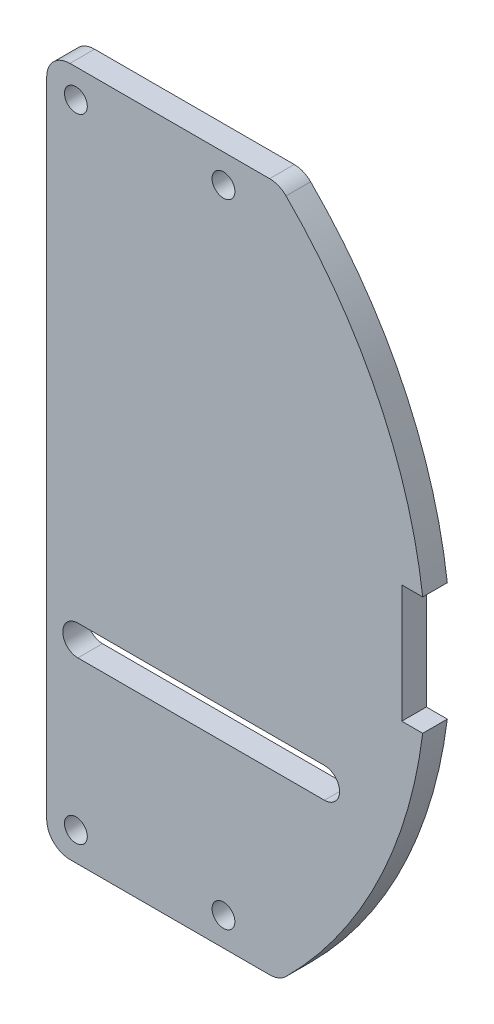
ISO-10303-21;
HEADER;
FILE_DESCRIPTION(('STEP AP214'),'2;1');
FILE_NAME('part.step','',(''),(''),'','','');
FILE_SCHEMA(('AUTOMOTIVE_DESIGN { 1 0 10303 214 1 1 1 1 }'));
ENDSEC;
DATA;
#1=APPLICATION_CONTEXT('core data for automotive mechanical design processes');
#2=APPLICATION_PROTOCOL_DEFINITION('international standard','automotive_design',2000,#1);
#3=PRODUCT_CONTEXT('',#1,'mechanical');
#4=PRODUCT('Part','Part','',(#3));
#5=PRODUCT_RELATED_PRODUCT_CATEGORY('part','',(#4));
#6=PRODUCT_DEFINITION_FORMATION('','',#4);
#7=PRODUCT_DEFINITION_CONTEXT('part definition',#1,'design');
#8=PRODUCT_DEFINITION('design','',#6,#7);
#9=PRODUCT_DEFINITION_SHAPE('','',#8);
#10=(LENGTH_UNIT() NAMED_UNIT(*) SI_UNIT(.MILLI.,.METRE.));
#11=(NAMED_UNIT(*) PLANE_ANGLE_UNIT() SI_UNIT($,.RADIAN.));
#12=(NAMED_UNIT(*) SI_UNIT($,.STERADIAN.) SOLID_ANGLE_UNIT());
#13=UNCERTAINTY_MEASURE_WITH_UNIT(LENGTH_MEASURE(1.E-05),#10,'distance_accuracy_value','');
#14=(GEOMETRIC_REPRESENTATION_CONTEXT(3) GLOBAL_UNCERTAINTY_ASSIGNED_CONTEXT((#13)) GLOBAL_UNIT_ASSIGNED_CONTEXT((#10,
#11,#12)) REPRESENTATION_CONTEXT('',''));
#15=CARTESIAN_POINT('',(0.,0.,0.));
#16=DIRECTION('',(0.,0.,1.));
#17=DIRECTION('',(1.,0.,0.));
#18=AXIS2_PLACEMENT_3D('',#15,#16,#17);
#19=CARTESIAN_POINT('',(-6.37024460958813E-09,0.,3.175));
#20=DIRECTION('',(0.,0.,-1.));
#21=DIRECTION('',(-1.,0.,0.));
#22=AXIS2_PLACEMENT_3D('',#19,#20,#21);
#23=CYLINDRICAL_SURFACE('',#22,61.5950000044044);
#24=CARTESIAN_POINT('',(-6.37024460958813E-09,0.,0.));
#25=DIRECTION('',(0.,0.,1.));
#26=DIRECTION('',(-1.,0.,0.));
#27=AXIS2_PLACEMENT_3D('',#24,#25,#26);
#28=CIRCLE('',#27,61.5950000044044);
#29=CARTESIAN_POINT('',(61.1218424523006,7.62000000000063,0.));
#30=VERTEX_POINT('',#29);
#31=CARTESIAN_POINT('',(43.4836153604898,43.6247546717406,0.));
#32=VERTEX_POINT('',#31);
#33=EDGE_CURVE('E258',#30,#32,#28,.T.);
#34=ORIENTED_EDGE('',*,*,#33,.T.);
#35=DIRECTION('',(0.,0.,-1.));
#36=VECTOR('',#35,1.);
#37=CARTESIAN_POINT('',(43.4836153604898,43.6247546717406,3.175));
#38=LINE('',#37,#36);
#39=CARTESIAN_POINT('',(43.4836153604898,43.6247546717406,3.175));
#40=VERTEX_POINT('',#39);
#41=EDGE_CURVE('E11',#32,#40,#38,.F.);
#42=ORIENTED_EDGE('',*,*,#41,.T.);
#43=CARTESIAN_POINT('',(-6.37024460958813E-09,0.,3.175));
#44=DIRECTION('',(0.,0.,1.));
#45=DIRECTION('',(-1.,0.,0.));
#46=AXIS2_PLACEMENT_3D('',#43,#44,#45);
#47=CIRCLE('',#46,61.5950000044044);
#48=CARTESIAN_POINT('',(61.1218424523006,7.62000000000063,3.175));
#49=VERTEX_POINT('',#48);
#50=EDGE_CURVE('E246',#49,#40,#47,.T.);
#51=ORIENTED_EDGE('',*,*,#50,.F.);
#52=DIRECTION('',(0.,0.,1.));
#53=VECTOR('',#52,1.);
#54=CARTESIAN_POINT('',(61.1218424523006,7.62000000000063,0.));
#55=LINE('',#54,#53);
#56=EDGE_CURVE('E209',#30,#49,#55,.T.);
#57=ORIENTED_EDGE('',*,*,#56,.F.);
#58=EDGE_LOOP('',(#34,#42,#51,#57));
#59=FACE_BOUND('',#58,.T.);
#60=ADVANCED_FACE('F39',(#59),#23,.T.);
#61=CARTESIAN_POINT('',(12.5874867185186,-44.5,3.175));
#62=DIRECTION('',(1.,0.,0.));
#63=DIRECTION('',(0.,0.,-1.));
#64=AXIS2_PLACEMENT_3D('',#61,#62,#63);
#65=PLANE('',#64);
#66=DIRECTION('',(0.,-1.,0.));
#67=VECTOR('',#66,1.);
#68=CARTESIAN_POINT('',(12.5874867185186,-44.5,0.));
#69=LINE('',#68,#67);
#70=CARTESIAN_POINT('',(12.5874867185186,41.5,0.));
#71=VERTEX_POINT('',#70);
#72=CARTESIAN_POINT('',(12.5874867185186,-41.5,0.));
#73=VERTEX_POINT('',#72);
#74=EDGE_CURVE('E236',#71,#73,#69,.T.);
#75=ORIENTED_EDGE('',*,*,#74,.T.);
#76=DIRECTION('',(0.,0.,-1.));
#77=VECTOR('',#76,1.);
#78=CARTESIAN_POINT('',(12.5874867185186,-41.5,3.175));
#79=LINE('',#78,#77);
#80=CARTESIAN_POINT('',(12.5874867185186,-41.5,3.175));
#81=VERTEX_POINT('',#80);
#82=EDGE_CURVE('E278',#73,#81,#79,.F.);
#83=ORIENTED_EDGE('',*,*,#82,.T.);
#84=DIRECTION('',(0.,-1.,0.));
#85=VECTOR('',#84,1.);
#86=CARTESIAN_POINT('',(12.5874867185186,-44.5,3.175));
#87=LINE('',#86,#85);
#88=CARTESIAN_POINT('',(12.5874867185186,41.5,3.175));
#89=VERTEX_POINT('',#88);
#90=EDGE_CURVE('E239',#89,#81,#87,.T.);
#91=ORIENTED_EDGE('',*,*,#90,.F.);
#92=DIRECTION('',(0.,0.,-1.));
#93=VECTOR('',#92,1.);
#94=CARTESIAN_POINT('',(12.5874867185186,41.5,3.175));
#95=LINE('',#94,#93);
#96=EDGE_CURVE('E275',#89,#71,#95,.T.);
#97=ORIENTED_EDGE('',*,*,#96,.T.);
#98=EDGE_LOOP('',(#75,#83,#91,#97));
#99=FACE_BOUND('',#98,.T.);
#100=ADVANCED_FACE('F310',(#99),#65,.F.);
#101=CARTESIAN_POINT('',(12.5874867185186,-44.5,3.175));
#102=DIRECTION('',(0.,1.,0.));
#103=DIRECTION('',(0.,0.,1.));
#104=AXIS2_PLACEMENT_3D('',#101,#102,#103);
#105=PLANE('',#104);
#106=DIRECTION('',(1.,0.,0.));
#107=VECTOR('',#106,1.);
#108=CARTESIAN_POINT('',(12.5874867185186,-44.5,3.175));
#109=LINE('',#108,#107);
#110=CARTESIAN_POINT('',(15.5874867185186,-44.5,3.175));
#111=VERTEX_POINT('',#110);
#112=CARTESIAN_POINT('',(41.365734914167,-44.5,3.175));
#113=VERTEX_POINT('',#112);
#114=EDGE_CURVE('E242',#111,#113,#109,.T.);
#115=ORIENTED_EDGE('',*,*,#114,.F.);
#116=DIRECTION('',(0.,0.,-1.));
#117=VECTOR('',#116,1.);
#118=CARTESIAN_POINT('',(15.5874867185186,-44.5,3.175));
#119=LINE('',#118,#117);
#120=CARTESIAN_POINT('',(15.5874867185186,-44.5,0.));
#121=VERTEX_POINT('',#120);
#122=EDGE_CURVE('E264',#111,#121,#119,.T.);
#123=ORIENTED_EDGE('',*,*,#122,.T.);
#124=DIRECTION('',(1.,0.,0.));
#125=VECTOR('',#124,1.);
#126=CARTESIAN_POINT('',(12.5874867185186,-44.5,0.));
#127=LINE('',#126,#125);
#128=CARTESIAN_POINT('',(41.365734914167,-44.5,0.));
#129=VERTEX_POINT('',#128);
#130=EDGE_CURVE('E255',#121,#129,#127,.T.);
#131=ORIENTED_EDGE('',*,*,#130,.T.);
#132=DIRECTION('',(0.,0.,-1.));
#133=VECTOR('',#132,1.);
#134=CARTESIAN_POINT('',(41.365734914167,-44.5,3.175));
#135=LINE('',#134,#133);
#136=EDGE_CURVE('E252',#129,#113,#135,.F.);
#137=ORIENTED_EDGE('',*,*,#136,.T.);
#138=EDGE_LOOP('',(#115,#123,#131,#137));
#139=FACE_BOUND('',#138,.T.);
#140=ADVANCED_FACE('F320',(#139),#105,.F.);
#141=CARTESIAN_POINT('',(43.4836153604898,-43.6247546717406,3.175));
#142=VERTEX_POINT('',#141);
#143=CARTESIAN_POINT('',(61.1218424523007,-7.6199999999994,3.175));
#144=VERTEX_POINT('',#143);
#145=EDGE_CURVE('E247',#142,#144,#47,.T.);
#146=ORIENTED_EDGE('',*,*,#145,.F.);
#147=DIRECTION('',(0.,0.,-1.));
#148=VECTOR('',#147,1.);
#149=CARTESIAN_POINT('',(43.4836153604898,-43.6247546717406,3.175));
#150=LINE('',#149,#148);
#151=CARTESIAN_POINT('',(43.4836153604898,-43.6247546717406,0.));
#152=VERTEX_POINT('',#151);
#153=EDGE_CURVE('E288',#142,#152,#150,.T.);
#154=ORIENTED_EDGE('',*,*,#153,.T.);
#155=CARTESIAN_POINT('',(61.1218424523007,-7.61999999999937,0.));
#156=VERTEX_POINT('',#155);
#157=EDGE_CURVE('E259',#152,#156,#28,.T.);
#158=ORIENTED_EDGE('',*,*,#157,.T.);
#159=DIRECTION('',(0.,0.,1.));
#160=VECTOR('',#159,1.);
#161=CARTESIAN_POINT('',(61.1218424523007,-7.6199999999994,0.));
#162=LINE('',#161,#160);
#163=EDGE_CURVE('E211',#156,#144,#162,.T.);
#164=ORIENTED_EDGE('',*,*,#163,.T.);
#165=EDGE_LOOP('',(#146,#154,#158,#164));
#166=FACE_BOUND('',#165,.T.);
#167=ADVANCED_FACE('F329',(#166),#23,.T.);
#168=CARTESIAN_POINT('',(12.5874867185186,44.5,3.175));
#169=DIRECTION('',(0.,-1.,0.));
#170=DIRECTION('',(1.,0.,0.));
#171=AXIS2_PLACEMENT_3D('',#168,#169,#170);
#172=PLANE('',#171);
#173=DIRECTION('',(-1.,0.,0.));
#174=VECTOR('',#173,1.);
#175=CARTESIAN_POINT('',(12.5874867185186,44.5,0.));
#176=LINE('',#175,#174);
#177=CARTESIAN_POINT('',(41.365734914167,44.5,0.));
#178=VERTEX_POINT('',#177);
#179=CARTESIAN_POINT('',(15.5874867185186,44.5,0.));
#180=VERTEX_POINT('',#179);
#181=EDGE_CURVE('E243',#178,#180,#176,.T.);
#182=ORIENTED_EDGE('',*,*,#181,.T.);
#183=DIRECTION('',(0.,0.,-1.));
#184=VECTOR('',#183,1.);
#185=CARTESIAN_POINT('',(15.5874867185186,44.5,3.175));
#186=LINE('',#185,#184);
#187=CARTESIAN_POINT('',(15.5874867185186,44.5,3.175));
#188=VERTEX_POINT('',#187);
#189=EDGE_CURVE('E47',#180,#188,#186,.F.);
#190=ORIENTED_EDGE('',*,*,#189,.T.);
#191=DIRECTION('',(-1.,0.,0.));
#192=VECTOR('',#191,1.);
#193=CARTESIAN_POINT('',(12.5874867185186,44.5,3.175));
#194=LINE('',#193,#192);
#195=CARTESIAN_POINT('',(41.365734914167,44.5,3.175));
#196=VERTEX_POINT('',#195);
#197=EDGE_CURVE('E249',#196,#188,#194,.T.);
#198=ORIENTED_EDGE('',*,*,#197,.F.);
#199=DIRECTION('',(0.,0.,-1.));
#200=VECTOR('',#199,1.);
#201=CARTESIAN_POINT('',(41.365734914167,44.5,3.175));
#202=LINE('',#201,#200);
#203=EDGE_CURVE('E291',#196,#178,#202,.T.);
#204=ORIENTED_EDGE('',*,*,#203,.T.);
#205=EDGE_LOOP('',(#182,#190,#198,#204));
#206=FACE_BOUND('',#205,.T.);
#207=ADVANCED_FACE('F296',(#206),#172,.F.);
#208=CARTESIAN_POINT('',(-6.37024460958813E-09,0.,3.175));
#209=DIRECTION('',(0.,0.,-1.));
#210=DIRECTION('',(-1.,0.,0.));
#211=AXIS2_PLACEMENT_3D('',#208,#209,#210);
#212=PLANE('',#211);
#213=DIRECTION('',(1.,0.,0.));
#214=VECTOR('',#213,1.);
#215=CARTESIAN_POINT('',(16.6121620614427,-21.4457630129671,3.175));
#216=LINE('',#215,#214);
#217=CARTESIAN_POINT('',(16.6121620614427,-21.4457630129671,3.175));
#218=VERTEX_POINT('',#217);
#219=CARTESIAN_POINT('',(48.4447636024084,-21.4457630129671,3.175));
#220=VERTEX_POINT('',#219);
#221=EDGE_CURVE('E178',#218,#220,#216,.T.);
#222=ORIENTED_EDGE('',*,*,#221,.F.);
#223=CARTESIAN_POINT('',(16.6121620614427,-19.5000000000013,3.175));
#224=DIRECTION('',(0.,0.,1.));
#225=DIRECTION('',(1.,0.,0.));
#226=AXIS2_PLACEMENT_3D('',#223,#224,#225);
#227=CIRCLE('',#226,1.94576301296578);
#228=CARTESIAN_POINT('',(16.6121620614427,-17.5542369870355,3.175));
#229=VERTEX_POINT('',#228);
#230=EDGE_CURVE('E54',#229,#218,#227,.T.);
#231=ORIENTED_EDGE('',*,*,#230,.F.);
#232=DIRECTION('',(-1.,0.,0.));
#233=VECTOR('',#232,1.);
#234=CARTESIAN_POINT('',(16.6121620614427,-17.5542369870355,3.175));
#235=LINE('',#234,#233);
#236=CARTESIAN_POINT('',(48.4447636024084,-17.5542369870355,3.175));
#237=VERTEX_POINT('',#236);
#238=EDGE_CURVE('E169',#237,#229,#235,.T.);
#239=ORIENTED_EDGE('',*,*,#238,.F.);
#240=CARTESIAN_POINT('',(48.4447636024084,-19.5000000000013,3.175));
#241=DIRECTION('',(0.,0.,1.));
#242=DIRECTION('',(1.,0.,0.));
#243=AXIS2_PLACEMENT_3D('',#240,#241,#242);
#244=CIRCLE('',#243,1.94576301296578);
#245=EDGE_CURVE('E172',#220,#237,#244,.T.);
#246=ORIENTED_EDGE('',*,*,#245,.F.);
#247=EDGE_LOOP('',(#222,#231,#239,#246));
#248=FACE_BOUND('',#247,.T.);
#249=CARTESIAN_POINT('',(16.3543111861162,40.8118922104986,3.175));
#250=DIRECTION('',(0.,0.,1.));
#251=DIRECTION('',(-1.,0.,0.));
#252=AXIS2_PLACEMENT_3D('',#249,#250,#251);
#253=CIRCLE('',#252,1.4732);
#254=CARTESIAN_POINT('',(14.8811111861162,40.8118922104986,3.175));
#255=VERTEX_POINT('',#254);
#256=EDGE_CURVE('E221',#255,#255,#253,.T.);
#257=ORIENTED_EDGE('',*,*,#256,.F.);
#258=EDGE_LOOP('',(#257));
#259=FACE_BOUND('',#258,.T.);
#260=CARTESIAN_POINT('',(35.4043111861162,-40.8118922104987,3.175));
#261=DIRECTION('',(0.,0.,1.));
#262=DIRECTION('',(1.,0.,0.));
#263=AXIS2_PLACEMENT_3D('',#260,#261,#262);
#264=CIRCLE('',#263,1.4732);
#265=CARTESIAN_POINT('',(36.8775111861162,-40.8118922104987,3.175));
#266=VERTEX_POINT('',#265);
#267=EDGE_CURVE('E228',#266,#266,#264,.T.);
#268=ORIENTED_EDGE('',*,*,#267,.F.);
#269=EDGE_LOOP('',(#268));
#270=FACE_BOUND('',#269,.T.);
#271=CARTESIAN_POINT('',(35.4043111861162,40.8118922104986,3.175));
#272=DIRECTION('',(0.,0.,1.));
#273=DIRECTION('',(-1.,0.,0.));
#274=AXIS2_PLACEMENT_3D('',#271,#272,#273);
#275=CIRCLE('',#274,1.4732);
#276=CARTESIAN_POINT('',(33.9311111861162,40.8118922104986,3.175));
#277=VERTEX_POINT('',#276);
#278=EDGE_CURVE('E215',#277,#277,#275,.T.);
#279=ORIENTED_EDGE('',*,*,#278,.F.);
#280=EDGE_LOOP('',(#279));
#281=FACE_BOUND('',#280,.T.);
#282=CARTESIAN_POINT('',(16.3543111861162,-40.8118922104987,3.175));
#283=DIRECTION('',(0.,0.,1.));
#284=DIRECTION('',(1.,0.,0.));
#285=AXIS2_PLACEMENT_3D('',#282,#283,#284);
#286=CIRCLE('',#285,1.4732);
#287=CARTESIAN_POINT('',(17.8275111861162,-40.8118922104987,3.175));
#288=VERTEX_POINT('',#287);
#289=EDGE_CURVE('E224',#288,#288,#286,.T.);
#290=ORIENTED_EDGE('',*,*,#289,.F.);
#291=EDGE_LOOP('',(#290));
#292=FACE_BOUND('',#291,.T.);
#293=ORIENTED_EDGE('',*,*,#90,.T.);
#294=CARTESIAN_POINT('',(15.5874867185186,-41.5,3.175));
#295=DIRECTION('',(0.,0.,-1.));
#296=DIRECTION('',(-1.,0.,0.));
#297=AXIS2_PLACEMENT_3D('',#294,#295,#296);
#298=CIRCLE('',#297,3.);
#299=EDGE_CURVE('E286',#81,#111,#298,.F.);
#300=ORIENTED_EDGE('',*,*,#299,.T.);
#301=ORIENTED_EDGE('',*,*,#114,.T.);
#302=CARTESIAN_POINT('',(41.365734914167,-41.5,3.175));
#303=DIRECTION('',(0.,0.,-1.));
#304=DIRECTION('',(-1.,0.,0.));
#305=AXIS2_PLACEMENT_3D('',#302,#303,#304);
#306=CIRCLE('',#305,3.);
#307=EDGE_CURVE('E284',#113,#142,#306,.F.);
#308=ORIENTED_EDGE('',*,*,#307,.T.);
#309=ORIENTED_EDGE('',*,*,#145,.T.);
#310=DIRECTION('',(1.,0.,0.));
#311=VECTOR('',#310,1.);
#312=CARTESIAN_POINT('',(58.4200000000001,-7.6199999999994,3.175));
#313=LINE('',#312,#311);
#314=CARTESIAN_POINT('',(58.4200000000001,-7.6199999999994,3.175));
#315=VERTEX_POINT('',#314);
#316=EDGE_CURVE('E201',#315,#144,#313,.T.);
#317=ORIENTED_EDGE('',*,*,#316,.F.);
#318=DIRECTION('',(0.,-1.,0.));
#319=VECTOR('',#318,1.);
#320=CARTESIAN_POINT('',(58.4199999999999,7.6200000000006,3.175));
#321=LINE('',#320,#319);
#322=CARTESIAN_POINT('',(58.4199999999999,7.6200000000006,3.175));
#323=VERTEX_POINT('',#322);
#324=EDGE_CURVE('E184',#323,#315,#321,.T.);
#325=ORIENTED_EDGE('',*,*,#324,.F.);
#326=DIRECTION('',(-1.,0.,0.));
#327=VECTOR('',#326,1.);
#328=CARTESIAN_POINT('',(58.4199999999999,7.6200000000006,3.175));
#329=LINE('',#328,#327);
#330=EDGE_CURVE('E192',#49,#323,#329,.T.);
#331=ORIENTED_EDGE('',*,*,#330,.F.);
#332=ORIENTED_EDGE('',*,*,#50,.T.);
#333=CARTESIAN_POINT('',(41.365734914167,41.5,3.175));
#334=DIRECTION('',(0.,0.,-1.));
#335=DIRECTION('',(-1.,0.,0.));
#336=AXIS2_PLACEMENT_3D('',#333,#334,#335);
#337=CIRCLE('',#336,3.);
#338=EDGE_CURVE('E280',#40,#196,#337,.F.);
#339=ORIENTED_EDGE('',*,*,#338,.T.);
#340=ORIENTED_EDGE('',*,*,#197,.T.);
#341=CARTESIAN_POINT('',(15.5874867185186,41.5,3.175));
#342=DIRECTION('',(0.,0.,-1.));
#343=DIRECTION('',(-1.,0.,0.));
#344=AXIS2_PLACEMENT_3D('',#341,#342,#343);
#345=CIRCLE('',#344,3.);
#346=EDGE_CURVE('E282',#188,#89,#345,.F.);
#347=ORIENTED_EDGE('',*,*,#346,.T.);
#348=EDGE_LOOP('',(#293,#300,#301,#308,#309,#317,#325,#331,#332,#339,#340,#347));
#349=FACE_BOUND('',#348,.T.);
#350=ADVANCED_FACE('F302',(#248,#259,#270,#281,#292,#349),#212,.F.);
#351=CARTESIAN_POINT('',(-6.37024460958813E-09,0.,0.));
#352=DIRECTION('',(0.,0.,-1.));
#353=DIRECTION('',(-1.,0.,0.));
#354=AXIS2_PLACEMENT_3D('',#351,#352,#353);
#355=PLANE('',#354);
#356=CARTESIAN_POINT('',(16.6121620614427,-19.5000000000013,0.));
#357=DIRECTION('',(0.,0.,1.));
#358=DIRECTION('',(1.,0.,0.));
#359=AXIS2_PLACEMENT_3D('',#356,#357,#358);
#360=CIRCLE('',#359,1.94576301296578);
#361=CARTESIAN_POINT('',(16.6121620614427,-17.5542369870355,0.));
#362=VERTEX_POINT('',#361);
#363=CARTESIAN_POINT('',(16.6121620614427,-21.4457630129671,0.));
#364=VERTEX_POINT('',#363);
#365=EDGE_CURVE('E153',#362,#364,#360,.T.);
#366=ORIENTED_EDGE('',*,*,#365,.T.);
#367=DIRECTION('',(1.,0.,0.));
#368=VECTOR('',#367,1.);
#369=CARTESIAN_POINT('',(16.6121620614427,-21.4457630129671,0.));
#370=LINE('',#369,#368);
#371=CARTESIAN_POINT('',(48.4447636024084,-21.4457630129671,0.));
#372=VERTEX_POINT('',#371);
#373=EDGE_CURVE('E162',#364,#372,#370,.T.);
#374=ORIENTED_EDGE('',*,*,#373,.T.);
#375=CARTESIAN_POINT('',(48.4447636024084,-19.5000000000013,0.));
#376=DIRECTION('',(0.,0.,1.));
#377=DIRECTION('',(1.,0.,0.));
#378=AXIS2_PLACEMENT_3D('',#375,#376,#377);
#379=CIRCLE('',#378,1.94576301296578);
#380=CARTESIAN_POINT('',(48.4447636024084,-17.5542369870355,0.));
#381=VERTEX_POINT('',#380);
#382=EDGE_CURVE('E62',#372,#381,#379,.T.);
#383=ORIENTED_EDGE('',*,*,#382,.T.);
#384=DIRECTION('',(-1.,0.,0.));
#385=VECTOR('',#384,1.);
#386=CARTESIAN_POINT('',(16.6121620614427,-17.5542369870355,0.));
#387=LINE('',#386,#385);
#388=EDGE_CURVE('E159',#381,#362,#387,.T.);
#389=ORIENTED_EDGE('',*,*,#388,.T.);
#390=EDGE_LOOP('',(#366,#374,#383,#389));
#391=FACE_BOUND('',#390,.T.);
#392=ORIENTED_EDGE('',*,*,#130,.F.);
#393=CARTESIAN_POINT('',(15.5874867185186,-41.5,0.));
#394=DIRECTION('',(0.,0.,-1.));
#395=DIRECTION('',(-1.,0.,0.));
#396=AXIS2_PLACEMENT_3D('',#393,#394,#395);
#397=CIRCLE('',#396,3.);
#398=EDGE_CURVE('E273',#121,#73,#397,.T.);
#399=ORIENTED_EDGE('',*,*,#398,.T.);
#400=ORIENTED_EDGE('',*,*,#74,.F.);
#401=CARTESIAN_POINT('',(15.5874867185186,41.5,0.));
#402=DIRECTION('',(0.,0.,-1.));
#403=DIRECTION('',(-1.,0.,0.));
#404=AXIS2_PLACEMENT_3D('',#401,#402,#403);
#405=CIRCLE('',#404,3.);
#406=EDGE_CURVE('E269',#71,#180,#405,.T.);
#407=ORIENTED_EDGE('',*,*,#406,.T.);
#408=ORIENTED_EDGE('',*,*,#181,.F.);
#409=CARTESIAN_POINT('',(41.365734914167,41.5,0.));
#410=DIRECTION('',(0.,0.,-1.));
#411=DIRECTION('',(-1.,0.,0.));
#412=AXIS2_PLACEMENT_3D('',#409,#410,#411);
#413=CIRCLE('',#412,3.);
#414=EDGE_CURVE('E267',#178,#32,#413,.T.);
#415=ORIENTED_EDGE('',*,*,#414,.T.);
#416=ORIENTED_EDGE('',*,*,#33,.F.);
#417=DIRECTION('',(-1.,0.,0.));
#418=VECTOR('',#417,1.);
#419=CARTESIAN_POINT('',(58.4199999999999,7.6200000000006,0.));
#420=LINE('',#419,#418);
#421=CARTESIAN_POINT('',(58.4199999999999,7.6200000000006,0.));
#422=VERTEX_POINT('',#421);
#423=EDGE_CURVE('E195',#30,#422,#420,.T.);
#424=ORIENTED_EDGE('',*,*,#423,.T.);
#425=DIRECTION('',(0.,-1.,0.));
#426=VECTOR('',#425,1.);
#427=CARTESIAN_POINT('',(58.4199999999999,7.6200000000006,0.));
#428=LINE('',#427,#426);
#429=CARTESIAN_POINT('',(58.4200000000001,-7.6199999999994,0.));
#430=VERTEX_POINT('',#429);
#431=EDGE_CURVE('E188',#422,#430,#428,.T.);
#432=ORIENTED_EDGE('',*,*,#431,.T.);
#433=DIRECTION('',(1.,0.,0.));
#434=VECTOR('',#433,1.);
#435=CARTESIAN_POINT('',(58.4200000000001,-7.6199999999994,0.));
#436=LINE('',#435,#434);
#437=EDGE_CURVE('E191',#430,#156,#436,.T.);
#438=ORIENTED_EDGE('',*,*,#437,.T.);
#439=ORIENTED_EDGE('',*,*,#157,.F.);
#440=CARTESIAN_POINT('',(41.365734914167,-41.5,0.));
#441=DIRECTION('',(0.,0.,-1.));
#442=DIRECTION('',(-1.,0.,0.));
#443=AXIS2_PLACEMENT_3D('',#440,#441,#442);
#444=CIRCLE('',#443,3.);
#445=EDGE_CURVE('E271',#152,#129,#444,.T.);
#446=ORIENTED_EDGE('',*,*,#445,.T.);
#447=EDGE_LOOP('',(#392,#399,#400,#407,#408,#415,#416,#424,#432,#438,#439,#446));
#448=FACE_BOUND('',#447,.T.);
#449=CARTESIAN_POINT('',(16.3543111861162,40.8118922104986,0.));
#450=DIRECTION('',(0.,0.,1.));
#451=DIRECTION('',(-1.,0.,0.));
#452=AXIS2_PLACEMENT_3D('',#449,#450,#451);
#453=CIRCLE('',#452,1.4732);
#454=CARTESIAN_POINT('',(14.8811111861162,40.8118922104986,0.));
#455=VERTEX_POINT('',#454);
#456=EDGE_CURVE('E225',#455,#455,#453,.T.);
#457=ORIENTED_EDGE('',*,*,#456,.T.);
#458=EDGE_LOOP('',(#457));
#459=FACE_BOUND('',#458,.T.);
#460=CARTESIAN_POINT('',(35.4043111861162,-40.8118922104987,0.));
#461=DIRECTION('',(0.,0.,1.));
#462=DIRECTION('',(1.,0.,0.));
#463=AXIS2_PLACEMENT_3D('',#460,#461,#462);
#464=CIRCLE('',#463,1.4732);
#465=CARTESIAN_POINT('',(36.8775111861162,-40.8118922104987,0.));
#466=VERTEX_POINT('',#465);
#467=EDGE_CURVE('E218',#466,#466,#464,.T.);
#468=ORIENTED_EDGE('',*,*,#467,.T.);
#469=EDGE_LOOP('',(#468));
#470=FACE_BOUND('',#469,.T.);
#471=CARTESIAN_POINT('',(35.4043111861162,40.8118922104986,0.));
#472=DIRECTION('',(0.,0.,1.));
#473=DIRECTION('',(-1.,0.,0.));
#474=AXIS2_PLACEMENT_3D('',#471,#472,#473);
#475=CIRCLE('',#474,1.4732);
#476=CARTESIAN_POINT('',(33.9311111861162,40.8118922104986,0.));
#477=VERTEX_POINT('',#476);
#478=EDGE_CURVE('E208',#477,#477,#475,.T.);
#479=ORIENTED_EDGE('',*,*,#478,.T.);
#480=EDGE_LOOP('',(#479));
#481=FACE_BOUND('',#480,.T.);
#482=CARTESIAN_POINT('',(16.3543111861162,-40.8118922104987,0.));
#483=DIRECTION('',(0.,0.,1.));
#484=DIRECTION('',(1.,0.,0.));
#485=AXIS2_PLACEMENT_3D('',#482,#483,#484);
#486=CIRCLE('',#485,1.4732);
#487=CARTESIAN_POINT('',(17.8275111861162,-40.8118922104987,0.));
#488=VERTEX_POINT('',#487);
#489=EDGE_CURVE('E233',#488,#488,#486,.T.);
#490=ORIENTED_EDGE('',*,*,#489,.T.);
#491=EDGE_LOOP('',(#490));
#492=FACE_BOUND('',#491,.T.);
#493=ADVANCED_FACE('F166',(#391,#448,#459,#470,#481,#492),#355,.T.);
#494=CARTESIAN_POINT('',(16.3543111861162,-40.8118922104987,0.));
#495=DIRECTION('',(0.,0.,1.));
#496=DIRECTION('',(1.,0.,0.));
#497=AXIS2_PLACEMENT_3D('',#494,#495,#496);
#498=CYLINDRICAL_SURFACE('',#497,1.4732);
#499=ORIENTED_EDGE('',*,*,#489,.F.);
#500=EDGE_LOOP('',(#499));
#501=FACE_BOUND('',#500,.T.);
#502=ORIENTED_EDGE('',*,*,#289,.T.);
#503=EDGE_LOOP('',(#502));
#504=FACE_BOUND('',#503,.T.);
#505=ADVANCED_FACE('F411',(#501,#504),#498,.F.);
#506=CARTESIAN_POINT('',(35.4043111861162,40.8118922104986,0.));
#507=DIRECTION('',(0.,0.,1.));
#508=DIRECTION('',(1.,0.,0.));
#509=AXIS2_PLACEMENT_3D('',#506,#507,#508);
#510=CYLINDRICAL_SURFACE('',#509,1.4732);
#511=ORIENTED_EDGE('',*,*,#478,.F.);
#512=EDGE_LOOP('',(#511));
#513=FACE_BOUND('',#512,.T.);
#514=ORIENTED_EDGE('',*,*,#278,.T.);
#515=EDGE_LOOP('',(#514));
#516=FACE_BOUND('',#515,.T.);
#517=ADVANCED_FACE('F514',(#513,#516),#510,.F.);
#518=CARTESIAN_POINT('',(35.4043111861162,-40.8118922104987,0.));
#519=DIRECTION('',(0.,0.,1.));
#520=DIRECTION('',(1.,0.,0.));
#521=AXIS2_PLACEMENT_3D('',#518,#519,#520);
#522=CYLINDRICAL_SURFACE('',#521,1.4732);
#523=ORIENTED_EDGE('',*,*,#467,.F.);
#524=EDGE_LOOP('',(#523));
#525=FACE_BOUND('',#524,.T.);
#526=ORIENTED_EDGE('',*,*,#267,.T.);
#527=EDGE_LOOP('',(#526));
#528=FACE_BOUND('',#527,.T.);
#529=ADVANCED_FACE('F504',(#525,#528),#522,.F.);
#530=CARTESIAN_POINT('',(16.3543111861162,40.8118922104986,0.));
#531=DIRECTION('',(0.,0.,1.));
#532=DIRECTION('',(1.,0.,0.));
#533=AXIS2_PLACEMENT_3D('',#530,#531,#532);
#534=CYLINDRICAL_SURFACE('',#533,1.4732);
#535=ORIENTED_EDGE('',*,*,#456,.F.);
#536=EDGE_LOOP('',(#535));
#537=FACE_BOUND('',#536,.T.);
#538=ORIENTED_EDGE('',*,*,#256,.T.);
#539=EDGE_LOOP('',(#538));
#540=FACE_BOUND('',#539,.T.);
#541=ADVANCED_FACE('F488',(#537,#540),#534,.F.);
#542=CARTESIAN_POINT('',(58.4199999999999,7.6200000000006,0.));
#543=DIRECTION('',(-1.,0.,0.));
#544=DIRECTION('',(0.,-1.,0.));
#545=AXIS2_PLACEMENT_3D('',#542,#543,#544);
#546=PLANE('',#545);
#547=ORIENTED_EDGE('',*,*,#324,.T.);
#548=DIRECTION('',(0.,0.,1.));
#549=VECTOR('',#548,1.);
#550=CARTESIAN_POINT('',(58.4200000000001,-7.6199999999994,0.));
#551=LINE('',#550,#549);
#552=EDGE_CURVE('E198',#430,#315,#551,.T.);
#553=ORIENTED_EDGE('',*,*,#552,.F.);
#554=ORIENTED_EDGE('',*,*,#431,.F.);
#555=DIRECTION('',(0.,0.,1.));
#556=VECTOR('',#555,1.);
#557=CARTESIAN_POINT('',(58.4199999999999,7.6200000000006,0.));
#558=LINE('',#557,#556);
#559=EDGE_CURVE('E206',#422,#323,#558,.T.);
#560=ORIENTED_EDGE('',*,*,#559,.T.);
#561=EDGE_LOOP('',(#547,#553,#554,#560));
#562=FACE_BOUND('',#561,.T.);
#563=ADVANCED_FACE('F340',(#562),#546,.F.);
#564=CARTESIAN_POINT('',(58.4199999999999,7.6200000000006,0.));
#565=DIRECTION('',(0.,1.,0.));
#566=DIRECTION('',(-1.,0.,0.));
#567=AXIS2_PLACEMENT_3D('',#564,#565,#566);
#568=PLANE('',#567);
#569=ORIENTED_EDGE('',*,*,#330,.T.);
#570=ORIENTED_EDGE('',*,*,#559,.F.);
#571=ORIENTED_EDGE('',*,*,#423,.F.);
#572=ORIENTED_EDGE('',*,*,#56,.T.);
#573=EDGE_LOOP('',(#569,#570,#571,#572));
#574=FACE_BOUND('',#573,.T.);
#575=ADVANCED_FACE('F342',(#574),#568,.F.);
#576=CARTESIAN_POINT('',(58.4200000000001,-7.6199999999994,0.));
#577=DIRECTION('',(0.,-1.,0.));
#578=DIRECTION('',(1.,0.,0.));
#579=AXIS2_PLACEMENT_3D('',#576,#577,#578);
#580=PLANE('',#579);
#581=ORIENTED_EDGE('',*,*,#316,.T.);
#582=ORIENTED_EDGE('',*,*,#163,.F.);
#583=ORIENTED_EDGE('',*,*,#437,.F.);
#584=ORIENTED_EDGE('',*,*,#552,.T.);
#585=EDGE_LOOP('',(#581,#582,#583,#584));
#586=FACE_BOUND('',#585,.T.);
#587=ADVANCED_FACE('F334',(#586),#580,.F.);
#588=CARTESIAN_POINT('',(15.5874867185186,-41.5,3.175));
#589=DIRECTION('',(0.,0.,-1.));
#590=DIRECTION('',(-1.,0.,0.));
#591=AXIS2_PLACEMENT_3D('',#588,#589,#590);
#592=CYLINDRICAL_SURFACE('',#591,3.);
#593=ORIENTED_EDGE('',*,*,#299,.F.);
#594=ORIENTED_EDGE('',*,*,#82,.F.);
#595=ORIENTED_EDGE('',*,*,#398,.F.);
#596=ORIENTED_EDGE('',*,*,#122,.F.);
#597=EDGE_LOOP('',(#593,#594,#595,#596));
#598=FACE_BOUND('',#597,.T.);
#599=ADVANCED_FACE('F317',(#598),#592,.T.);
#600=CARTESIAN_POINT('',(41.365734914167,-41.5,3.175));
#601=DIRECTION('',(0.,0.,-1.));
#602=DIRECTION('',(-1.,0.,0.));
#603=AXIS2_PLACEMENT_3D('',#600,#601,#602);
#604=CYLINDRICAL_SURFACE('',#603,3.);
#605=ORIENTED_EDGE('',*,*,#307,.F.);
#606=ORIENTED_EDGE('',*,*,#136,.F.);
#607=ORIENTED_EDGE('',*,*,#445,.F.);
#608=ORIENTED_EDGE('',*,*,#153,.F.);
#609=EDGE_LOOP('',(#605,#606,#607,#608));
#610=FACE_BOUND('',#609,.T.);
#611=ADVANCED_FACE('F326',(#610),#604,.T.);
#612=CARTESIAN_POINT('',(15.5874867185186,41.5,3.175));
#613=DIRECTION('',(0.,0.,-1.));
#614=DIRECTION('',(-1.,0.,0.));
#615=AXIS2_PLACEMENT_3D('',#612,#613,#614);
#616=CYLINDRICAL_SURFACE('',#615,3.);
#617=ORIENTED_EDGE('',*,*,#346,.F.);
#618=ORIENTED_EDGE('',*,*,#189,.F.);
#619=ORIENTED_EDGE('',*,*,#406,.F.);
#620=ORIENTED_EDGE('',*,*,#96,.F.);
#621=EDGE_LOOP('',(#617,#618,#619,#620));
#622=FACE_BOUND('',#621,.T.);
#623=ADVANCED_FACE('F307',(#622),#616,.T.);
#624=CARTESIAN_POINT('',(41.365734914167,41.5,3.175));
#625=DIRECTION('',(0.,0.,-1.));
#626=DIRECTION('',(-1.,0.,0.));
#627=AXIS2_PLACEMENT_3D('',#624,#625,#626);
#628=CYLINDRICAL_SURFACE('',#627,3.);
#629=ORIENTED_EDGE('',*,*,#338,.F.);
#630=ORIENTED_EDGE('',*,*,#41,.F.);
#631=ORIENTED_EDGE('',*,*,#414,.F.);
#632=ORIENTED_EDGE('',*,*,#203,.F.);
#633=EDGE_LOOP('',(#629,#630,#631,#632));
#634=FACE_BOUND('',#633,.T.);
#635=ADVANCED_FACE('F41',(#634),#628,.T.);
#636=CARTESIAN_POINT('',(16.6121620614427,-19.5000000000013,0.));
#637=DIRECTION('',(0.,0.,1.));
#638=DIRECTION('',(1.,0.,0.));
#639=AXIS2_PLACEMENT_3D('',#636,#637,#638);
#640=CYLINDRICAL_SURFACE('',#639,1.94576301296578);
#641=ORIENTED_EDGE('',*,*,#230,.T.);
#642=DIRECTION('',(0.,0.,1.));
#643=VECTOR('',#642,1.);
#644=CARTESIAN_POINT('',(16.6121620614427,-21.4457630129671,0.));
#645=LINE('',#644,#643);
#646=EDGE_CURVE('E149',#364,#218,#645,.T.);
#647=ORIENTED_EDGE('',*,*,#646,.F.);
#648=ORIENTED_EDGE('',*,*,#365,.F.);
#649=DIRECTION('',(0.,0.,1.));
#650=VECTOR('',#649,1.);
#651=CARTESIAN_POINT('',(16.6121620614427,-17.5542369870355,0.));
#652=LINE('',#651,#650);
#653=EDGE_CURVE('E182',#362,#229,#652,.T.);
#654=ORIENTED_EDGE('',*,*,#653,.T.);
#655=EDGE_LOOP('',(#641,#647,#648,#654));
#656=FACE_BOUND('',#655,.T.);
#657=ADVANCED_FACE('F151',(#656),#640,.F.);
#658=CARTESIAN_POINT('',(16.6121620614427,-17.5542369870355,0.));
#659=DIRECTION('',(0.,1.,0.));
#660=DIRECTION('',(0.,0.,1.));
#661=AXIS2_PLACEMENT_3D('',#658,#659,#660);
#662=PLANE('',#661);
#663=ORIENTED_EDGE('',*,*,#238,.T.);
#664=ORIENTED_EDGE('',*,*,#653,.F.);
#665=ORIENTED_EDGE('',*,*,#388,.F.);
#666=DIRECTION('',(0.,0.,1.));
#667=VECTOR('',#666,1.);
#668=CARTESIAN_POINT('',(48.4447636024084,-17.5542369870355,0.));
#669=LINE('',#668,#667);
#670=EDGE_CURVE('E185',#381,#237,#669,.T.);
#671=ORIENTED_EDGE('',*,*,#670,.T.);
#672=EDGE_LOOP('',(#663,#664,#665,#671));
#673=FACE_BOUND('',#672,.T.);
#674=ADVANCED_FACE('F354',(#673),#662,.F.);
#675=CARTESIAN_POINT('',(48.4447636024084,-19.5000000000013,0.));
#676=DIRECTION('',(0.,0.,1.));
#677=DIRECTION('',(1.,0.,0.));
#678=AXIS2_PLACEMENT_3D('',#675,#676,#677);
#679=CYLINDRICAL_SURFACE('',#678,1.94576301296578);
#680=ORIENTED_EDGE('',*,*,#245,.T.);
#681=ORIENTED_EDGE('',*,*,#670,.F.);
#682=ORIENTED_EDGE('',*,*,#382,.F.);
#683=DIRECTION('',(0.,0.,1.));
#684=VECTOR('',#683,1.);
#685=CARTESIAN_POINT('',(48.4447636024084,-21.4457630129671,0.));
#686=LINE('',#685,#684);
#687=EDGE_CURVE('E158',#372,#220,#686,.T.);
#688=ORIENTED_EDGE('',*,*,#687,.T.);
#689=EDGE_LOOP('',(#680,#681,#682,#688));
#690=FACE_BOUND('',#689,.T.);
#691=ADVANCED_FACE('F429',(#690),#679,.F.);
#692=CARTESIAN_POINT('',(16.6121620614427,-21.4457630129671,0.));
#693=DIRECTION('',(0.,-1.,0.));
#694=DIRECTION('',(0.,0.,-1.));
#695=AXIS2_PLACEMENT_3D('',#692,#693,#694);
#696=PLANE('',#695);
#697=ORIENTED_EDGE('',*,*,#221,.T.);
#698=ORIENTED_EDGE('',*,*,#687,.F.);
#699=ORIENTED_EDGE('',*,*,#373,.F.);
#700=ORIENTED_EDGE('',*,*,#646,.T.);
#701=EDGE_LOOP('',(#697,#698,#699,#700));
#702=FACE_BOUND('',#701,.T.);
#703=ADVANCED_FACE('F163',(#702),#696,.F.);
#704=CLOSED_SHELL('',(#60,#100,#140,#167,#207,#350,#493,#505,#517,#529,#541,#563,#575,#587,#599,
#611,#623,#635,#657,#674,#691,#703));
#705=MANIFOLD_SOLID_BREP('B2',#704);
#706=ADVANCED_BREP_SHAPE_REPRESENTATION('',(#18,#705),#14);
#707=SHAPE_DEFINITION_REPRESENTATION(#9,#706);
ENDSEC;
END-ISO-10303-21;
